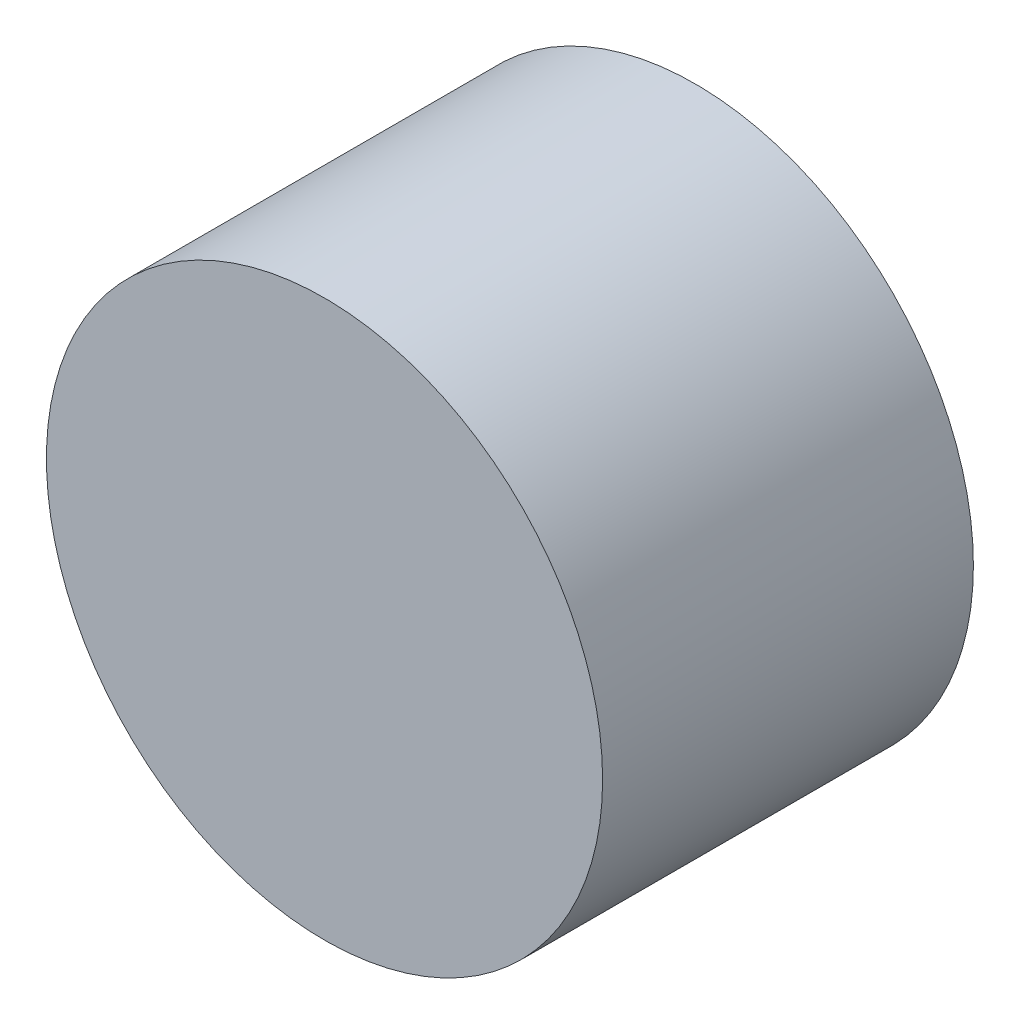
ISO-10303-21;
HEADER;
FILE_DESCRIPTION(('STEP AP214'),'2;1');
FILE_NAME('part.step','',(''),(''),'','','');
FILE_SCHEMA(('AUTOMOTIVE_DESIGN { 1 0 10303 214 1 1 1 1 }'));
ENDSEC;
DATA;
#1=APPLICATION_CONTEXT('core data for automotive mechanical design processes');
#2=APPLICATION_PROTOCOL_DEFINITION('international standard','automotive_design',2000,#1);
#3=PRODUCT_CONTEXT('',#1,'mechanical');
#4=PRODUCT('Part','Part','',(#3));
#5=PRODUCT_RELATED_PRODUCT_CATEGORY('part','',(#4));
#6=PRODUCT_DEFINITION_FORMATION('','',#4);
#7=PRODUCT_DEFINITION_CONTEXT('part definition',#1,'design');
#8=PRODUCT_DEFINITION('design','',#6,#7);
#9=PRODUCT_DEFINITION_SHAPE('','',#8);
#10=(LENGTH_UNIT() NAMED_UNIT(*) SI_UNIT(.MILLI.,.METRE.));
#11=(NAMED_UNIT(*) PLANE_ANGLE_UNIT() SI_UNIT($,.RADIAN.));
#12=(NAMED_UNIT(*) SI_UNIT($,.STERADIAN.) SOLID_ANGLE_UNIT());
#13=UNCERTAINTY_MEASURE_WITH_UNIT(LENGTH_MEASURE(1.E-05),#10,'distance_accuracy_value','');
#14=(GEOMETRIC_REPRESENTATION_CONTEXT(3) GLOBAL_UNCERTAINTY_ASSIGNED_CONTEXT((#13)) GLOBAL_UNIT_ASSIGNED_CONTEXT((#10,
#11,#12)) REPRESENTATION_CONTEXT('',''));
#15=CARTESIAN_POINT('',(0.,0.,0.));
#16=DIRECTION('',(0.,0.,1.));
#17=DIRECTION('',(1.,0.,0.));
#18=AXIS2_PLACEMENT_3D('',#15,#16,#17);
#19=CARTESIAN_POINT('',(0.,0.,10.));
#20=DIRECTION('',(0.,0.,-1.));
#21=DIRECTION('',(-1.,0.,0.));
#22=AXIS2_PLACEMENT_3D('',#19,#20,#21);
#23=CYLINDRICAL_SURFACE('',#22,7.5);
#24=CARTESIAN_POINT('',(0.,0.,10.));
#25=DIRECTION('',(0.,0.,1.));
#26=DIRECTION('',(1.,0.,0.));
#27=AXIS2_PLACEMENT_3D('',#24,#25,#26);
#28=CIRCLE('',#27,7.5);
#29=CARTESIAN_POINT('',(7.5,0.,10.));
#30=VERTEX_POINT('',#29);
#31=EDGE_CURVE('E10',#30,#30,#28,.T.);
#32=ORIENTED_EDGE('',*,*,#31,.F.);
#33=EDGE_LOOP('',(#32));
#34=FACE_BOUND('',#33,.T.);
#35=CARTESIAN_POINT('',(0.,0.,0.));
#36=DIRECTION('',(0.,0.,1.));
#37=DIRECTION('',(1.,0.,0.));
#38=AXIS2_PLACEMENT_3D('',#35,#36,#37);
#39=CIRCLE('',#38,7.5);
#40=CARTESIAN_POINT('',(7.5,0.,0.));
#41=VERTEX_POINT('',#40);
#42=EDGE_CURVE('E34',#41,#41,#39,.T.);
#43=ORIENTED_EDGE('',*,*,#42,.T.);
#44=EDGE_LOOP('',(#43));
#45=FACE_BOUND('',#44,.T.);
#46=ADVANCED_FACE('F31',(#34,#45),#23,.T.);
#47=CARTESIAN_POINT('',(0.,0.,10.));
#48=DIRECTION('',(0.,0.,1.));
#49=DIRECTION('',(1.,0.,0.));
#50=AXIS2_PLACEMENT_3D('',#47,#48,#49);
#51=PLANE('',#50);
#52=ORIENTED_EDGE('',*,*,#31,.T.);
#53=EDGE_LOOP('',(#52));
#54=FACE_BOUND('',#53,.T.);
#55=ADVANCED_FACE('F46',(#54),#51,.T.);
#56=CARTESIAN_POINT('',(0.,0.,0.));
#57=DIRECTION('',(0.,0.,1.));
#58=DIRECTION('',(1.,0.,0.));
#59=AXIS2_PLACEMENT_3D('',#56,#57,#58);
#60=PLANE('',#59);
#61=ORIENTED_EDGE('',*,*,#42,.F.);
#62=EDGE_LOOP('',(#61));
#63=FACE_BOUND('',#62,.T.);
#64=ADVANCED_FACE('F44',(#63),#60,.F.);
#65=CLOSED_SHELL('',(#46,#55,#64));
#66=MANIFOLD_SOLID_BREP('B2',#65);
#67=ADVANCED_BREP_SHAPE_REPRESENTATION('',(#18,#66),#14);
#68=SHAPE_DEFINITION_REPRESENTATION(#9,#67);
ENDSEC;
END-ISO-10303-21;
